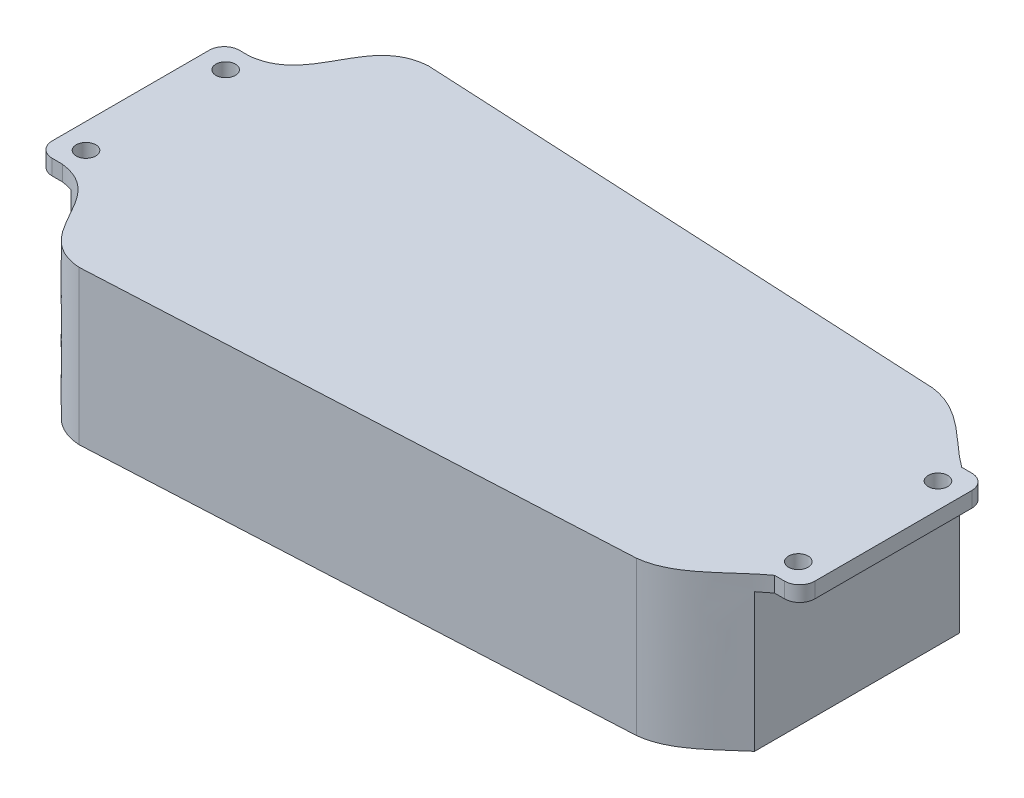
ISO-10303-21;
HEADER;
FILE_DESCRIPTION(('STEP AP214'),'2;1');
FILE_NAME('part.step','',(''),(''),'','','');
FILE_SCHEMA(('AUTOMOTIVE_DESIGN { 1 0 10303 214 1 1 1 1 }'));
ENDSEC;
DATA;
#1=APPLICATION_CONTEXT('core data for automotive mechanical design processes');
#2=APPLICATION_PROTOCOL_DEFINITION('international standard','automotive_design',2000,#1);
#3=PRODUCT_CONTEXT('',#1,'mechanical');
#4=PRODUCT('Part','Part','',(#3));
#5=PRODUCT_RELATED_PRODUCT_CATEGORY('part','',(#4));
#6=PRODUCT_DEFINITION_FORMATION('','',#4);
#7=PRODUCT_DEFINITION_CONTEXT('part definition',#1,'design');
#8=PRODUCT_DEFINITION('design','',#6,#7);
#9=PRODUCT_DEFINITION_SHAPE('','',#8);
#10=(LENGTH_UNIT() NAMED_UNIT(*) SI_UNIT(.MILLI.,.METRE.));
#11=(NAMED_UNIT(*) PLANE_ANGLE_UNIT() SI_UNIT($,.RADIAN.));
#12=(NAMED_UNIT(*) SI_UNIT($,.STERADIAN.) SOLID_ANGLE_UNIT());
#13=UNCERTAINTY_MEASURE_WITH_UNIT(LENGTH_MEASURE(1.E-05),#10,'distance_accuracy_value','');
#14=(GEOMETRIC_REPRESENTATION_CONTEXT(3) GLOBAL_UNCERTAINTY_ASSIGNED_CONTEXT((#13)) GLOBAL_UNIT_ASSIGNED_CONTEXT((#10,
#11,#12)) REPRESENTATION_CONTEXT('',''));
#15=CARTESIAN_POINT('',(0.,0.,0.));
#16=DIRECTION('',(0.,0.,1.));
#17=DIRECTION('',(1.,0.,0.));
#18=AXIS2_PLACEMENT_3D('',#15,#16,#17);
#19=CARTESIAN_POINT('',(-115.897393364929,-55.,32.5431279620853));
#20=DIRECTION('',(0.,-1.,0.));
#21=DIRECTION('',(0.,0.,-1.));
#22=AXIS2_PLACEMENT_3D('',#19,#20,#21);
#23=PLANE('',#22);
#24=CARTESIAN_POINT('',(142.702606635071,-55.,-29.0568720379147));
#25=CARTESIAN_POINT('',(133.287763268237,-55.,-35.7757587441816));
#26=CARTESIAN_POINT('',(125.082628435847,-55.,-47.1414686898549));
#27=CARTESIAN_POINT('',(112.637979465165,-55.,-48.4568720379147));
#28=B_SPLINE_CURVE_WITH_KNOTS('',3,(#24,#25,#26,#27),.UNSPECIFIED.,.F.,.F.,(4,4),(0.,1.),.UNSPECIFIED.);
#29=CARTESIAN_POINT('',(138.702606635071,-55.,-32.1976654202332));
#30=VERTEX_POINT('',#29);
#31=CARTESIAN_POINT('',(112.637979465165,-55.,-48.4568720379147));
#32=VERTEX_POINT('',#31);
#33=EDGE_CURVE('E536',#30,#32,#28,.T.);
#34=ORIENTED_EDGE('',*,*,#33,.F.);
#35=DIRECTION('',(0.,0.,1.));
#36=VECTOR('',#35,1.);
#37=CARTESIAN_POINT('',(138.702606635071,-55.,32.5431279620853));
#38=LINE('',#37,#36);
#39=CARTESIAN_POINT('',(138.702606635071,-55.,41.0839213444004));
#40=VERTEX_POINT('',#39);
#41=EDGE_CURVE('E273',#30,#40,#38,.T.);
#42=ORIENTED_EDGE('',*,*,#41,.T.);
#43=CARTESIAN_POINT('',(112.637979465165,-55.,57.3431279620853));
#44=CARTESIAN_POINT('',(125.082628435847,-55.,56.0277246140255));
#45=CARTESIAN_POINT('',(133.287763268237,-55.,44.6620146683521));
#46=CARTESIAN_POINT('',(142.702606635071,-55.,37.9431279620853));
#47=B_SPLINE_CURVE_WITH_KNOTS('',3,(#43,#44,#45,#46),.UNSPECIFIED.,.F.,.F.,(4,4),(0.,1.),.UNSPECIFIED.);
#48=CARTESIAN_POINT('',(112.637979465165,-55.,57.3431279620853));
#49=VERTEX_POINT('',#48);
#50=EDGE_CURVE('E542',#49,#40,#47,.T.);
#51=ORIENTED_EDGE('',*,*,#50,.F.);
#52=DIRECTION('',(0.998725119042121,0.,-0.0504790708541747));
#53=VECTOR('',#52,1.);
#54=CARTESIAN_POINT('',(-77.2973933649289,-55.,66.9431279620853));
#55=LINE('',#54,#53);
#56=CARTESIAN_POINT('',(-77.2973933649289,-55.,66.9431279620853));
#57=VERTEX_POINT('',#56);
#58=EDGE_CURVE('E349',#57,#49,#55,.T.);
#59=ORIENTED_EDGE('',*,*,#58,.F.);
#60=CARTESIAN_POINT('',(-112.297393364929,-55.,37.9431279620853));
#61=CARTESIAN_POINT('',(-92.6699085338427,-55.,40.1856361833209));
#62=CARTESIAN_POINT('',(-97.4782956804953,-55.,65.4447991108473));
#63=CARTESIAN_POINT('',(-77.2973933649289,-55.,66.9431279620853));
#64=B_SPLINE_CURVE_WITH_KNOTS('',3,(#60,#61,#62,#63),.UNSPECIFIED.,.F.,.F.,(4,4),(0.,1.),.UNSPECIFIED.);
#65=CARTESIAN_POINT('',(-108.297393364929,-55.,38.8081296548846));
#66=VERTEX_POINT('',#65);
#67=EDGE_CURVE('E343',#66,#57,#64,.T.);
#68=ORIENTED_EDGE('',*,*,#67,.F.);
#69=DIRECTION('',(0.,0.,-1.));
#70=VECTOR('',#69,1.);
#71=CARTESIAN_POINT('',(-108.297393364929,-55.,32.5431279620853));
#72=LINE('',#71,#70);
#73=CARTESIAN_POINT('',(-108.297393359178,-55.,-29.921873730714));
#74=VERTEX_POINT('',#73);
#75=EDGE_CURVE('E48',#66,#74,#72,.T.);
#76=ORIENTED_EDGE('',*,*,#75,.T.);
#77=CARTESIAN_POINT('',(-77.2973933649289,-55.,-58.0568720379147));
#78=CARTESIAN_POINT('',(-97.4782956804952,-55.,-56.5585431866767));
#79=CARTESIAN_POINT('',(-92.6699085338428,-55.,-31.2993802591503));
#80=CARTESIAN_POINT('',(-112.297393364929,-55.,-29.0568720379147));
#81=B_SPLINE_CURVE_WITH_KNOTS('',3,(#77,#78,#79,#80),.UNSPECIFIED.,.F.,.F.,(4,4),(0.,1.),.UNSPECIFIED.);
#82=CARTESIAN_POINT('',(-77.2973933649289,-55.,-58.0568720379147));
#83=VERTEX_POINT('',#82);
#84=EDGE_CURVE('E232',#83,#74,#81,.T.);
#85=ORIENTED_EDGE('',*,*,#84,.F.);
#86=DIRECTION('',(-0.998725119042121,0.,-0.0504790708541746));
#87=VECTOR('',#86,1.);
#88=CARTESIAN_POINT('',(-77.2973933649289,-55.,-58.0568720379147));
#89=LINE('',#88,#87);
#90=EDGE_CURVE('E410',#32,#83,#89,.T.);
#91=ORIENTED_EDGE('',*,*,#90,.F.);
#92=EDGE_LOOP('',(#34,#42,#51,#59,#68,#76,#85,#91));
#93=FACE_BOUND('',#92,.T.);
#94=ADVANCED_FACE('F39',(#93),#23,.T.);
#95=CARTESIAN_POINT('',(-115.897393364929,-55.,32.5431279620853));
#96=DIRECTION('',(0.,1.,0.));
#97=DIRECTION('',(0.,0.,1.));
#98=AXIS2_PLACEMENT_3D('',#95,#96,#97);
#99=CYLINDRICAL_SURFACE('',#98,5.4);
#100=CARTESIAN_POINT('',(-115.897393364929,-5.5,32.5431279620853));
#101=DIRECTION('',(0.,1.,0.));
#102=DIRECTION('',(0.,0.,1.));
#103=AXIS2_PLACEMENT_3D('',#100,#101,#102);
#104=CIRCLE('',#103,5.4);
#105=CARTESIAN_POINT('',(-115.897393364929,-5.5,37.9431279620853));
#106=VERTEX_POINT('',#105);
#107=CARTESIAN_POINT('',(-121.297393364929,-5.5,32.5431279620853));
#108=VERTEX_POINT('',#107);
#109=EDGE_CURVE('E300',#106,#108,#104,.F.);
#110=ORIENTED_EDGE('',*,*,#109,.F.);
#111=DIRECTION('',(0.,1.,0.));
#112=VECTOR('',#111,1.);
#113=CARTESIAN_POINT('',(-115.897393364929,-55.,37.9431279620853));
#114=LINE('',#113,#112);
#115=CARTESIAN_POINT('',(-115.897393364929,0.,37.9431279620853));
#116=VERTEX_POINT('',#115);
#117=EDGE_CURVE('E229',#106,#116,#114,.T.);
#118=ORIENTED_EDGE('',*,*,#117,.T.);
#119=CARTESIAN_POINT('',(-115.897393364929,0.,32.5431279620853));
#120=DIRECTION('',(0.,1.,0.));
#121=DIRECTION('',(0.,0.,-1.));
#122=AXIS2_PLACEMENT_3D('',#119,#120,#121);
#123=CIRCLE('',#122,5.4);
#124=CARTESIAN_POINT('',(-121.297393364929,0.,32.5431279620853));
#125=VERTEX_POINT('',#124);
#126=EDGE_CURVE('E342',#125,#116,#123,.T.);
#127=ORIENTED_EDGE('',*,*,#126,.F.);
#128=DIRECTION('',(0.,1.,0.));
#129=VECTOR('',#128,1.);
#130=CARTESIAN_POINT('',(-121.297393364929,-55.,32.5431279620853));
#131=LINE('',#130,#129);
#132=EDGE_CURVE('E240',#108,#125,#131,.T.);
#133=ORIENTED_EDGE('',*,*,#132,.F.);
#134=EDGE_LOOP('',(#110,#118,#127,#133));
#135=FACE_BOUND('',#134,.T.);
#136=ADVANCED_FACE('F41',(#135),#99,.T.);
#137=CARTESIAN_POINT('',(-121.297393364929,-55.,-23.6568720379147));
#138=DIRECTION('',(-1.,0.,0.));
#139=DIRECTION('',(0.,0.,1.));
#140=AXIS2_PLACEMENT_3D('',#137,#138,#139);
#141=PLANE('',#140);
#142=DIRECTION('',(0.,0.,-1.));
#143=VECTOR('',#142,1.);
#144=CARTESIAN_POINT('',(-121.297393364929,-5.5,-30.1667131943031));
#145=LINE('',#144,#143);
#146=CARTESIAN_POINT('',(-121.297393364929,-5.5,-23.6568720379147));
#147=VERTEX_POINT('',#146);
#148=EDGE_CURVE('E284',#108,#147,#145,.T.);
#149=ORIENTED_EDGE('',*,*,#148,.F.);
#150=ORIENTED_EDGE('',*,*,#132,.T.);
#151=DIRECTION('',(0.,0.,1.));
#152=VECTOR('',#151,1.);
#153=CARTESIAN_POINT('',(-121.297393364929,0.,-23.6568720379147));
#154=LINE('',#153,#152);
#155=CARTESIAN_POINT('',(-121.297393364929,0.,-23.6568720379147));
#156=VERTEX_POINT('',#155);
#157=EDGE_CURVE('E350',#156,#125,#154,.T.);
#158=ORIENTED_EDGE('',*,*,#157,.F.);
#159=DIRECTION('',(0.,1.,0.));
#160=VECTOR('',#159,1.);
#161=CARTESIAN_POINT('',(-121.297393364929,-55.,-23.6568720379147));
#162=LINE('',#161,#160);
#163=EDGE_CURVE('E496',#147,#156,#162,.T.);
#164=ORIENTED_EDGE('',*,*,#163,.F.);
#165=EDGE_LOOP('',(#149,#150,#158,#164));
#166=FACE_BOUND('',#165,.T.);
#167=ADVANCED_FACE('F379',(#166),#141,.T.);
#168=CARTESIAN_POINT('',(-115.897393364929,-55.,-23.6568720379147));
#169=DIRECTION('',(0.,1.,0.));
#170=DIRECTION('',(0.,0.,1.));
#171=AXIS2_PLACEMENT_3D('',#168,#169,#170);
#172=CYLINDRICAL_SURFACE('',#171,5.4);
#173=CARTESIAN_POINT('',(-115.897393364929,-5.5,-23.6568720379147));
#174=DIRECTION('',(0.,1.,0.));
#175=DIRECTION('',(0.,0.,1.));
#176=AXIS2_PLACEMENT_3D('',#173,#174,#175);
#177=CIRCLE('',#176,5.4);
#178=CARTESIAN_POINT('',(-115.897393364929,-5.5,-29.0568720379147));
#179=VERTEX_POINT('',#178);
#180=EDGE_CURVE('E317',#147,#179,#177,.F.);
#181=ORIENTED_EDGE('',*,*,#180,.F.);
#182=ORIENTED_EDGE('',*,*,#163,.T.);
#183=CARTESIAN_POINT('',(-115.897393364929,0.,-23.6568720379147));
#184=DIRECTION('',(0.,1.,0.));
#185=DIRECTION('',(0.,0.,1.));
#186=AXIS2_PLACEMENT_3D('',#183,#184,#185);
#187=CIRCLE('',#186,5.4);
#188=CARTESIAN_POINT('',(-115.897393364929,0.,-29.0568720379147));
#189=VERTEX_POINT('',#188);
#190=EDGE_CURVE('E487',#189,#156,#187,.T.);
#191=ORIENTED_EDGE('',*,*,#190,.F.);
#192=DIRECTION('',(0.,1.,0.));
#193=VECTOR('',#192,1.);
#194=CARTESIAN_POINT('',(-115.897393364929,-55.,-29.0568720379147));
#195=LINE('',#194,#193);
#196=EDGE_CURVE('E499',#179,#189,#195,.T.);
#197=ORIENTED_EDGE('',*,*,#196,.F.);
#198=EDGE_LOOP('',(#181,#182,#191,#197));
#199=FACE_BOUND('',#198,.T.);
#200=ADVANCED_FACE('F387',(#199),#172,.T.);
#201=CARTESIAN_POINT('',(-115.797393364929,-55.,-29.0568720379147));
#202=DIRECTION('',(0.,0.,-1.));
#203=DIRECTION('',(-1.,0.,0.));
#204=AXIS2_PLACEMENT_3D('',#201,#202,#203);
#205=PLANE('',#204);
#206=DIRECTION('',(1.,0.,0.));
#207=VECTOR('',#206,1.);
#208=CARTESIAN_POINT('',(-115.797393364929,-5.5,-29.0568720379147));
#209=LINE('',#208,#207);
#210=CARTESIAN_POINT('',(-112.297393364929,-5.5,-29.0568720379147));
#211=VERTEX_POINT('',#210);
#212=EDGE_CURVE('E311',#179,#211,#209,.T.);
#213=ORIENTED_EDGE('',*,*,#212,.F.);
#214=ORIENTED_EDGE('',*,*,#196,.T.);
#215=DIRECTION('',(-1.,0.,0.));
#216=VECTOR('',#215,1.);
#217=CARTESIAN_POINT('',(-115.797393364929,0.,-29.0568720379147));
#218=LINE('',#217,#216);
#219=CARTESIAN_POINT('',(-112.297393364929,0.,-29.0568720379147));
#220=VERTEX_POINT('',#219);
#221=EDGE_CURVE('E480',#220,#189,#218,.T.);
#222=ORIENTED_EDGE('',*,*,#221,.F.);
#223=DIRECTION('',(0.,1.,0.));
#224=VECTOR('',#223,1.);
#225=CARTESIAN_POINT('',(-112.297393364929,-55.,-29.0568720379147));
#226=LINE('',#225,#224);
#227=EDGE_CURVE('E502',#211,#220,#226,.T.);
#228=ORIENTED_EDGE('',*,*,#227,.F.);
#229=EDGE_LOOP('',(#213,#214,#222,#228));
#230=FACE_BOUND('',#229,.T.);
#231=ADVANCED_FACE('F391',(#230),#205,.T.);
#232=DIRECTION('',(0.,1.,0.));
#233=VECTOR('',#232,1.);
#234=SURFACE_OF_LINEAR_EXTRUSION('',#81,#233);
#235=CARTESIAN_POINT('',(-77.2973933649289,-5.5,-58.0568720379147));
#236=CARTESIAN_POINT('',(-97.4782956804952,-5.5,-56.5585431866767));
#237=CARTESIAN_POINT('',(-92.6699085338428,-5.5,-31.2993802591503));
#238=CARTESIAN_POINT('',(-112.297393364929,-5.5,-29.0568720379147));
#239=B_SPLINE_CURVE_WITH_KNOTS('',3,(#235,#236,#237,#238),.UNSPECIFIED.,.F.,.F.,(4,4),(0.,1.),.UNSPECIFIED.);
#240=CARTESIAN_POINT('',(-108.297393364929,-5.5,-29.9218737288001));
#241=VERTEX_POINT('',#240);
#242=EDGE_CURVE('E306',#211,#241,#239,.F.);
#243=ORIENTED_EDGE('',*,*,#242,.F.);
#244=ORIENTED_EDGE('',*,*,#227,.T.);
#245=CARTESIAN_POINT('',(-77.2973933649289,0.,-58.0568720379147));
#246=CARTESIAN_POINT('',(-97.4782956804952,0.,-56.5585431866767));
#247=CARTESIAN_POINT('',(-92.6699085338428,0.,-31.2993802591503));
#248=CARTESIAN_POINT('',(-112.297393364929,0.,-29.0568720379147));
#249=B_SPLINE_CURVE_WITH_KNOTS('',3,(#245,#246,#247,#248),.UNSPECIFIED.,.F.,.F.,(4,4),(0.,1.),.UNSPECIFIED.);
#250=CARTESIAN_POINT('',(-77.2973933649289,0.,-58.0568720379147));
#251=VERTEX_POINT('',#250);
#252=EDGE_CURVE('E474',#251,#220,#249,.T.);
#253=ORIENTED_EDGE('',*,*,#252,.F.);
#254=DIRECTION('',(0.,1.,0.));
#255=VECTOR('',#254,1.);
#256=CARTESIAN_POINT('',(-77.2973933649289,-55.,-58.0568720379147));
#257=LINE('',#256,#255);
#258=EDGE_CURVE('E505',#83,#251,#257,.T.);
#259=ORIENTED_EDGE('',*,*,#258,.F.);
#260=ORIENTED_EDGE('',*,*,#84,.T.);
#261=DIRECTION('',(0.,1.,0.));
#262=VECTOR('',#261,1.);
#263=CARTESIAN_POINT('',(-108.297393364929,-55.,-29.9218737288001));
#264=LINE('',#263,#262);
#265=EDGE_CURVE('E63',#74,#241,#264,.T.);
#266=ORIENTED_EDGE('',*,*,#265,.T.);
#267=EDGE_LOOP('',(#243,#244,#253,#259,#260,#266));
#268=FACE_BOUND('',#267,.T.);
#269=ADVANCED_FACE('F395',(#268),#234,.T.);
#270=CARTESIAN_POINT('',(-77.2973933649289,-55.,-58.0568720379147));
#271=DIRECTION('',(0.0504790708541746,0.,-0.998725119042121));
#272=DIRECTION('',(-0.998725119042121,0.,-0.0504790708541746));
#273=AXIS2_PLACEMENT_3D('',#270,#271,#272);
#274=PLANE('',#273);
#275=DIRECTION('',(-0.998725119042121,0.,-0.0504790708541746));
#276=VECTOR('',#275,1.);
#277=CARTESIAN_POINT('',(-77.2973933649289,0.,-58.0568720379147));
#278=LINE('',#277,#276);
#279=CARTESIAN_POINT('',(112.637979465165,0.,-48.4568720379147));
#280=VERTEX_POINT('',#279);
#281=EDGE_CURVE('E467',#280,#251,#278,.T.);
#282=ORIENTED_EDGE('',*,*,#281,.F.);
#283=DIRECTION('',(0.,1.,0.));
#284=VECTOR('',#283,1.);
#285=CARTESIAN_POINT('',(112.637979465165,-55.,-48.4568720379147));
#286=LINE('',#285,#284);
#287=EDGE_CURVE('E508',#32,#280,#286,.T.);
#288=ORIENTED_EDGE('',*,*,#287,.F.);
#289=ORIENTED_EDGE('',*,*,#90,.T.);
#290=ORIENTED_EDGE('',*,*,#258,.T.);
#291=EDGE_LOOP('',(#282,#288,#289,#290));
#292=FACE_BOUND('',#291,.T.);
#293=ADVANCED_FACE('F400',(#292),#274,.T.);
#294=DIRECTION('',(0.,1.,0.));
#295=VECTOR('',#294,1.);
#296=SURFACE_OF_LINEAR_EXTRUSION('',#28,#295);
#297=CARTESIAN_POINT('',(142.702606635071,-5.5,-29.0568720379147));
#298=CARTESIAN_POINT('',(133.287763268237,-5.5,-35.7757587441816));
#299=CARTESIAN_POINT('',(125.082628435847,-5.5,-47.1414686898549));
#300=CARTESIAN_POINT('',(112.637979465165,-5.5,-48.4568720379147));
#301=B_SPLINE_CURVE_WITH_KNOTS('',3,(#297,#298,#299,#300),.UNSPECIFIED.,.F.,.F.,(4,4),(0.,1.),.UNSPECIFIED.);
#302=CARTESIAN_POINT('',(138.702606635071,-5.5,-32.1976654202298));
#303=VERTEX_POINT('',#302);
#304=CARTESIAN_POINT('',(142.702606635071,-5.5,-29.0568720379147));
#305=VERTEX_POINT('',#304);
#306=EDGE_CURVE('E268',#303,#305,#301,.F.);
#307=ORIENTED_EDGE('',*,*,#306,.F.);
#308=DIRECTION('',(0.,1.,0.));
#309=VECTOR('',#308,1.);
#310=CARTESIAN_POINT('',(138.702606635071,-55.,-32.1976654202298));
#311=LINE('',#310,#309);
#312=EDGE_CURVE('E280',#303,#30,#311,.F.);
#313=ORIENTED_EDGE('',*,*,#312,.T.);
#314=ORIENTED_EDGE('',*,*,#33,.T.);
#315=ORIENTED_EDGE('',*,*,#287,.T.);
#316=CARTESIAN_POINT('',(142.702606635071,0.,-29.0568720379147));
#317=CARTESIAN_POINT('',(133.287763268237,0.,-35.7757587441816));
#318=CARTESIAN_POINT('',(125.082628435847,0.,-47.1414686898549));
#319=CARTESIAN_POINT('',(112.637979465165,0.,-48.4568720379147));
#320=B_SPLINE_CURVE_WITH_KNOTS('',3,(#316,#317,#318,#319),.UNSPECIFIED.,.F.,.F.,(4,4),(0.,1.),.UNSPECIFIED.);
#321=CARTESIAN_POINT('',(142.702606635071,0.,-29.0568720379147));
#322=VERTEX_POINT('',#321);
#323=EDGE_CURVE('E461',#322,#280,#320,.T.);
#324=ORIENTED_EDGE('',*,*,#323,.F.);
#325=DIRECTION('',(0.,1.,0.));
#326=VECTOR('',#325,1.);
#327=CARTESIAN_POINT('',(142.702606635071,-55.,-29.0568720379147));
#328=LINE('',#327,#326);
#329=EDGE_CURVE('E209',#305,#322,#328,.T.);
#330=ORIENTED_EDGE('',*,*,#329,.F.);
#331=EDGE_LOOP('',(#307,#313,#314,#315,#324,#330));
#332=FACE_BOUND('',#331,.T.);
#333=ADVANCED_FACE('F518',(#332),#296,.T.);
#334=CARTESIAN_POINT('',(146.202606635071,-55.,-29.0568720379147));
#335=DIRECTION('',(0.,0.,-1.));
#336=DIRECTION('',(-1.,0.,0.));
#337=AXIS2_PLACEMENT_3D('',#334,#335,#336);
#338=PLANE('',#337);
#339=DIRECTION('',(1.,0.,0.));
#340=VECTOR('',#339,1.);
#341=CARTESIAN_POINT('',(146.202606635071,-5.5,-29.0568720379147));
#342=LINE('',#341,#340);
#343=CARTESIAN_POINT('',(146.302606635071,-5.5,-29.0568720379147));
#344=VERTEX_POINT('',#343);
#345=EDGE_CURVE('E184',#305,#344,#342,.T.);
#346=ORIENTED_EDGE('',*,*,#345,.F.);
#347=ORIENTED_EDGE('',*,*,#329,.T.);
#348=DIRECTION('',(-1.,0.,0.));
#349=VECTOR('',#348,1.);
#350=CARTESIAN_POINT('',(146.202606635071,0.,-29.0568720379147));
#351=LINE('',#350,#349);
#352=CARTESIAN_POINT('',(146.302606635071,0.,-29.0568720379147));
#353=VERTEX_POINT('',#352);
#354=EDGE_CURVE('E457',#353,#322,#351,.T.);
#355=ORIENTED_EDGE('',*,*,#354,.F.);
#356=DIRECTION('',(0.,1.,0.));
#357=VECTOR('',#356,1.);
#358=CARTESIAN_POINT('',(146.302606635071,-55.,-29.0568720379147));
#359=LINE('',#358,#357);
#360=EDGE_CURVE('E205',#344,#353,#359,.T.);
#361=ORIENTED_EDGE('',*,*,#360,.F.);
#362=EDGE_LOOP('',(#346,#347,#355,#361));
#363=FACE_BOUND('',#362,.T.);
#364=ADVANCED_FACE('F515',(#363),#338,.T.);
#365=CARTESIAN_POINT('',(146.302606635071,-55.,-23.6568720379147));
#366=DIRECTION('',(0.,1.,0.));
#367=DIRECTION('',(0.,0.,1.));
#368=AXIS2_PLACEMENT_3D('',#365,#366,#367);
#369=CYLINDRICAL_SURFACE('',#368,5.40000000000002);
#370=CARTESIAN_POINT('',(146.302606635071,-5.5,-23.6568720379147));
#371=DIRECTION('',(0.,1.,0.));
#372=DIRECTION('',(0.,0.,1.));
#373=AXIS2_PLACEMENT_3D('',#370,#371,#372);
#374=CIRCLE('',#373,5.40000000000002);
#375=CARTESIAN_POINT('',(151.702606635071,-5.5,-23.6568720379147));
#376=VERTEX_POINT('',#375);
#377=EDGE_CURVE('E177',#344,#376,#374,.F.);
#378=ORIENTED_EDGE('',*,*,#377,.F.);
#379=ORIENTED_EDGE('',*,*,#360,.T.);
#380=CARTESIAN_POINT('',(146.302606635071,0.,-23.6568720379147));
#381=DIRECTION('',(0.,1.,0.));
#382=DIRECTION('',(0.,0.,-1.));
#383=AXIS2_PLACEMENT_3D('',#380,#381,#382);
#384=CIRCLE('',#383,5.40000000000002);
#385=CARTESIAN_POINT('',(151.702606635071,0.,-23.6568720379147));
#386=VERTEX_POINT('',#385);
#387=EDGE_CURVE('E202',#386,#353,#384,.T.);
#388=ORIENTED_EDGE('',*,*,#387,.F.);
#389=DIRECTION('',(0.,1.,0.));
#390=VECTOR('',#389,1.);
#391=CARTESIAN_POINT('',(151.702606635071,-55.,-23.6568720379147));
#392=LINE('',#391,#390);
#393=EDGE_CURVE('E195',#376,#386,#392,.T.);
#394=ORIENTED_EDGE('',*,*,#393,.F.);
#395=EDGE_LOOP('',(#378,#379,#388,#394));
#396=FACE_BOUND('',#395,.T.);
#397=ADVANCED_FACE('F200',(#396),#369,.T.);
#398=CARTESIAN_POINT('',(151.702606635071,-55.,-23.6568720379147));
#399=DIRECTION('',(1.,0.,0.));
#400=DIRECTION('',(0.,0.,-1.));
#401=AXIS2_PLACEMENT_3D('',#398,#399,#400);
#402=PLANE('',#401);
#403=DIRECTION('',(0.,0.,1.));
#404=VECTOR('',#403,1.);
#405=CARTESIAN_POINT('',(151.702606635071,-5.5,42.5271998288506));
#406=LINE('',#405,#404);
#407=CARTESIAN_POINT('',(151.702606635071,-5.5,32.5431279620853));
#408=VERTEX_POINT('',#407);
#409=EDGE_CURVE('E181',#376,#408,#406,.T.);
#410=ORIENTED_EDGE('',*,*,#409,.F.);
#411=ORIENTED_EDGE('',*,*,#393,.T.);
#412=DIRECTION('',(0.,0.,-1.));
#413=VECTOR('',#412,1.);
#414=CARTESIAN_POINT('',(151.702606635071,0.,-23.6568720379147));
#415=LINE('',#414,#413);
#416=CARTESIAN_POINT('',(151.702606635071,0.,32.5431279620853));
#417=VERTEX_POINT('',#416);
#418=EDGE_CURVE('E452',#417,#386,#415,.T.);
#419=ORIENTED_EDGE('',*,*,#418,.F.);
#420=DIRECTION('',(0.,1.,0.));
#421=VECTOR('',#420,1.);
#422=CARTESIAN_POINT('',(151.702606635071,-55.,32.5431279620853));
#423=LINE('',#422,#421);
#424=EDGE_CURVE('E197',#408,#417,#423,.T.);
#425=ORIENTED_EDGE('',*,*,#424,.F.);
#426=EDGE_LOOP('',(#410,#411,#419,#425));
#427=FACE_BOUND('',#426,.T.);
#428=ADVANCED_FACE('F193',(#427),#402,.T.);
#429=CARTESIAN_POINT('',(146.302606635071,-55.,32.5431279620853));
#430=DIRECTION('',(0.,1.,0.));
#431=DIRECTION('',(0.,0.,1.));
#432=AXIS2_PLACEMENT_3D('',#429,#430,#431);
#433=CYLINDRICAL_SURFACE('',#432,5.40000000000002);
#434=CARTESIAN_POINT('',(146.302606635071,-5.5,32.5431279620853));
#435=DIRECTION('',(0.,1.,0.));
#436=DIRECTION('',(0.,0.,1.));
#437=AXIS2_PLACEMENT_3D('',#434,#435,#436);
#438=CIRCLE('',#437,5.40000000000002);
#439=CARTESIAN_POINT('',(146.302606635071,-5.5,37.9431279620853));
#440=VERTEX_POINT('',#439);
#441=EDGE_CURVE('E189',#408,#440,#438,.F.);
#442=ORIENTED_EDGE('',*,*,#441,.F.);
#443=ORIENTED_EDGE('',*,*,#424,.T.);
#444=CARTESIAN_POINT('',(146.302606635071,0.,32.5431279620853));
#445=DIRECTION('',(0.,1.,0.));
#446=DIRECTION('',(0.,0.,1.));
#447=AXIS2_PLACEMENT_3D('',#444,#445,#446);
#448=CIRCLE('',#447,5.40000000000002);
#449=CARTESIAN_POINT('',(146.302606635071,0.,37.9431279620853));
#450=VERTEX_POINT('',#449);
#451=EDGE_CURVE('E448',#450,#417,#448,.T.);
#452=ORIENTED_EDGE('',*,*,#451,.F.);
#453=DIRECTION('',(0.,1.,0.));
#454=VECTOR('',#453,1.);
#455=CARTESIAN_POINT('',(146.302606635071,-55.,37.9431279620853));
#456=LINE('',#455,#454);
#457=EDGE_CURVE('E211',#440,#450,#456,.T.);
#458=ORIENTED_EDGE('',*,*,#457,.F.);
#459=EDGE_LOOP('',(#442,#443,#452,#458));
#460=FACE_BOUND('',#459,.T.);
#461=ADVANCED_FACE('F526',(#460),#433,.T.);
#462=CARTESIAN_POINT('',(146.202606635071,-55.,37.9431279620853));
#463=DIRECTION('',(0.,0.,1.));
#464=DIRECTION('',(1.,0.,0.));
#465=AXIS2_PLACEMENT_3D('',#462,#463,#464);
#466=PLANE('',#465);
#467=DIRECTION('',(-1.,0.,0.));
#468=VECTOR('',#467,1.);
#469=CARTESIAN_POINT('',(146.202606635071,-5.5,37.9431279620853));
#470=LINE('',#469,#468);
#471=CARTESIAN_POINT('',(142.702606635071,-5.5,37.9431279620853));
#472=VERTEX_POINT('',#471);
#473=EDGE_CURVE('E258',#440,#472,#470,.T.);
#474=ORIENTED_EDGE('',*,*,#473,.F.);
#475=ORIENTED_EDGE('',*,*,#457,.T.);
#476=DIRECTION('',(1.,0.,0.));
#477=VECTOR('',#476,1.);
#478=CARTESIAN_POINT('',(146.202606635071,0.,37.9431279620853));
#479=LINE('',#478,#477);
#480=CARTESIAN_POINT('',(142.702606635071,0.,37.9431279620853));
#481=VERTEX_POINT('',#480);
#482=EDGE_CURVE('E441',#481,#450,#479,.T.);
#483=ORIENTED_EDGE('',*,*,#482,.F.);
#484=DIRECTION('',(0.,1.,0.));
#485=VECTOR('',#484,1.);
#486=CARTESIAN_POINT('',(142.702606635071,-55.,37.9431279620853));
#487=LINE('',#486,#485);
#488=EDGE_CURVE('E217',#472,#481,#487,.T.);
#489=ORIENTED_EDGE('',*,*,#488,.F.);
#490=EDGE_LOOP('',(#474,#475,#483,#489));
#491=FACE_BOUND('',#490,.T.);
#492=ADVANCED_FACE('F531',(#491),#466,.T.);
#493=DIRECTION('',(0.,1.,0.));
#494=VECTOR('',#493,1.);
#495=SURFACE_OF_LINEAR_EXTRUSION('',#47,#494);
#496=CARTESIAN_POINT('',(112.637979465165,-5.5,57.3431279620853));
#497=CARTESIAN_POINT('',(125.082628435847,-5.5,56.0277246140255));
#498=CARTESIAN_POINT('',(133.287763268237,-5.5,44.6620146683521));
#499=CARTESIAN_POINT('',(142.702606635071,-5.5,37.9431279620853));
#500=B_SPLINE_CURVE_WITH_KNOTS('',3,(#496,#497,#498,#499),.UNSPECIFIED.,.F.,.F.,(4,4),(0.,1.),.UNSPECIFIED.);
#501=CARTESIAN_POINT('',(138.702606635071,-5.5,41.0839213444004));
#502=VERTEX_POINT('',#501);
#503=EDGE_CURVE('E250',#472,#502,#500,.F.);
#504=ORIENTED_EDGE('',*,*,#503,.F.);
#505=ORIENTED_EDGE('',*,*,#488,.T.);
#506=CARTESIAN_POINT('',(112.637979465165,0.,57.3431279620853));
#507=CARTESIAN_POINT('',(125.082628435847,0.,56.0277246140255));
#508=CARTESIAN_POINT('',(133.287763268237,0.,44.6620146683521));
#509=CARTESIAN_POINT('',(142.702606635071,0.,37.9431279620853));
#510=B_SPLINE_CURVE_WITH_KNOTS('',3,(#506,#507,#508,#509),.UNSPECIFIED.,.F.,.F.,(4,4),(0.,1.),.UNSPECIFIED.);
#511=CARTESIAN_POINT('',(112.637979465165,0.,57.3431279620853));
#512=VERTEX_POINT('',#511);
#513=EDGE_CURVE('E435',#512,#481,#510,.T.);
#514=ORIENTED_EDGE('',*,*,#513,.F.);
#515=DIRECTION('',(0.,1.,0.));
#516=VECTOR('',#515,1.);
#517=CARTESIAN_POINT('',(112.637979465165,-55.,57.3431279620853));
#518=LINE('',#517,#516);
#519=EDGE_CURVE('E220',#49,#512,#518,.T.);
#520=ORIENTED_EDGE('',*,*,#519,.F.);
#521=ORIENTED_EDGE('',*,*,#50,.T.);
#522=DIRECTION('',(0.,1.,0.));
#523=VECTOR('',#522,1.);
#524=CARTESIAN_POINT('',(138.702606635071,-55.,41.0839213444004));
#525=LINE('',#524,#523);
#526=EDGE_CURVE('E11',#40,#502,#525,.T.);
#527=ORIENTED_EDGE('',*,*,#526,.T.);
#528=EDGE_LOOP('',(#504,#505,#514,#520,#521,#527));
#529=FACE_BOUND('',#528,.T.);
#530=ADVANCED_FACE('F534',(#529),#495,.T.);
#531=CARTESIAN_POINT('',(-77.2973933649289,-55.,66.9431279620853));
#532=DIRECTION('',(0.0504790708541747,0.,0.998725119042121));
#533=DIRECTION('',(0.998725119042121,0.,-0.0504790708541747));
#534=AXIS2_PLACEMENT_3D('',#531,#532,#533);
#535=PLANE('',#534);
#536=DIRECTION('',(0.998725119042121,0.,-0.0504790708541747));
#537=VECTOR('',#536,1.);
#538=CARTESIAN_POINT('',(-77.2973933649289,0.,66.9431279620853));
#539=LINE('',#538,#537);
#540=CARTESIAN_POINT('',(-77.2973933649289,0.,66.9431279620853));
#541=VERTEX_POINT('',#540);
#542=EDGE_CURVE('E428',#541,#512,#539,.T.);
#543=ORIENTED_EDGE('',*,*,#542,.F.);
#544=DIRECTION('',(0.,1.,0.));
#545=VECTOR('',#544,1.);
#546=CARTESIAN_POINT('',(-77.2973933649289,-55.,66.9431279620853));
#547=LINE('',#546,#545);
#548=EDGE_CURVE('E223',#57,#541,#547,.T.);
#549=ORIENTED_EDGE('',*,*,#548,.F.);
#550=ORIENTED_EDGE('',*,*,#58,.T.);
#551=ORIENTED_EDGE('',*,*,#519,.T.);
#552=EDGE_LOOP('',(#543,#549,#550,#551));
#553=FACE_BOUND('',#552,.T.);
#554=ADVANCED_FACE('F360',(#553),#535,.T.);
#555=DIRECTION('',(0.,1.,0.));
#556=VECTOR('',#555,1.);
#557=SURFACE_OF_LINEAR_EXTRUSION('',#64,#556);
#558=CARTESIAN_POINT('',(-112.297393364929,-5.5,37.9431279620853));
#559=CARTESIAN_POINT('',(-92.6699085338427,-5.5,40.1856361833209));
#560=CARTESIAN_POINT('',(-97.4782956804953,-5.5,65.4447991108473));
#561=CARTESIAN_POINT('',(-77.2973933649289,-5.5,66.9431279620853));
#562=B_SPLINE_CURVE_WITH_KNOTS('',3,(#558,#559,#560,#561),.UNSPECIFIED.,.F.,.F.,(4,4),(0.,1.),.UNSPECIFIED.);
#563=CARTESIAN_POINT('',(-108.297393364929,-5.5,38.8081296529707));
#564=VERTEX_POINT('',#563);
#565=CARTESIAN_POINT('',(-112.297393364929,-5.5,37.9431279620853));
#566=VERTEX_POINT('',#565);
#567=EDGE_CURVE('E295',#564,#566,#562,.F.);
#568=ORIENTED_EDGE('',*,*,#567,.F.);
#569=DIRECTION('',(0.,1.,0.));
#570=VECTOR('',#569,1.);
#571=CARTESIAN_POINT('',(-108.297393364929,-55.,38.8081296529707));
#572=LINE('',#571,#570);
#573=EDGE_CURVE('E320',#564,#66,#572,.F.);
#574=ORIENTED_EDGE('',*,*,#573,.T.);
#575=ORIENTED_EDGE('',*,*,#67,.T.);
#576=ORIENTED_EDGE('',*,*,#548,.T.);
#577=CARTESIAN_POINT('',(-112.297393364929,0.,37.9431279620853));
#578=CARTESIAN_POINT('',(-92.6699085338427,0.,40.1856361833209));
#579=CARTESIAN_POINT('',(-97.4782956804953,0.,65.4447991108473));
#580=CARTESIAN_POINT('',(-77.2973933649289,0.,66.9431279620853));
#581=B_SPLINE_CURVE_WITH_KNOTS('',3,(#577,#578,#579,#580),.UNSPECIFIED.,.F.,.F.,(4,4),(0.,1.),.UNSPECIFIED.);
#582=CARTESIAN_POINT('',(-112.297393364929,0.,37.9431279620853));
#583=VERTEX_POINT('',#582);
#584=EDGE_CURVE('E422',#583,#541,#581,.T.);
#585=ORIENTED_EDGE('',*,*,#584,.F.);
#586=DIRECTION('',(0.,1.,0.));
#587=VECTOR('',#586,1.);
#588=CARTESIAN_POINT('',(-112.297393364929,-55.,37.9431279620853));
#589=LINE('',#588,#587);
#590=EDGE_CURVE('E226',#566,#583,#589,.T.);
#591=ORIENTED_EDGE('',*,*,#590,.F.);
#592=EDGE_LOOP('',(#568,#574,#575,#576,#585,#591));
#593=FACE_BOUND('',#592,.T.);
#594=ADVANCED_FACE('F356',(#593),#557,.T.);
#595=CARTESIAN_POINT('',(-115.797393364929,-55.,37.9431279620853));
#596=DIRECTION('',(0.,0.,1.));
#597=DIRECTION('',(1.,0.,0.));
#598=AXIS2_PLACEMENT_3D('',#595,#596,#597);
#599=PLANE('',#598);
#600=DIRECTION('',(-1.,0.,0.));
#601=VECTOR('',#600,1.);
#602=CARTESIAN_POINT('',(-115.797393364929,-5.5,37.9431279620853));
#603=LINE('',#602,#601);
#604=EDGE_CURVE('E292',#566,#106,#603,.T.);
#605=ORIENTED_EDGE('',*,*,#604,.F.);
#606=ORIENTED_EDGE('',*,*,#590,.T.);
#607=DIRECTION('',(1.,0.,0.));
#608=VECTOR('',#607,1.);
#609=CARTESIAN_POINT('',(-115.797393364929,0.,37.9431279620853));
#610=LINE('',#609,#608);
#611=EDGE_CURVE('E418',#116,#583,#610,.T.);
#612=ORIENTED_EDGE('',*,*,#611,.F.);
#613=ORIENTED_EDGE('',*,*,#117,.F.);
#614=EDGE_LOOP('',(#605,#606,#612,#613));
#615=FACE_BOUND('',#614,.T.);
#616=ADVANCED_FACE('F359',(#615),#599,.T.);
#617=CARTESIAN_POINT('',(-115.897393364929,0.,32.5431279620853));
#618=DIRECTION('',(0.,-1.,0.));
#619=DIRECTION('',(0.,0.,-1.));
#620=AXIS2_PLACEMENT_3D('',#617,#618,#619);
#621=PLANE('',#620);
#622=CARTESIAN_POINT('',(142.702606635071,0.,-20.5568720379147));
#623=DIRECTION('',(0.,1.,0.));
#624=DIRECTION('',(0.,0.,-1.));
#625=AXIS2_PLACEMENT_3D('',#622,#623,#624);
#626=CIRCLE('',#625,3.49999999999999);
#627=CARTESIAN_POINT('',(142.702606635071,0.,-24.0568720379147));
#628=VERTEX_POINT('',#627);
#629=EDGE_CURVE('E326',#628,#628,#626,.T.);
#630=ORIENTED_EDGE('',*,*,#629,.F.);
#631=EDGE_LOOP('',(#630));
#632=FACE_BOUND('',#631,.T.);
#633=CARTESIAN_POINT('',(142.702606635071,0.,29.4431279620853));
#634=DIRECTION('',(0.,1.,0.));
#635=DIRECTION('',(0.,0.,-1.));
#636=AXIS2_PLACEMENT_3D('',#633,#634,#635);
#637=CIRCLE('',#636,3.49999999999999);
#638=CARTESIAN_POINT('',(142.702606635071,0.,25.9431279620853));
#639=VERTEX_POINT('',#638);
#640=EDGE_CURVE('E330',#639,#639,#637,.T.);
#641=ORIENTED_EDGE('',*,*,#640,.F.);
#642=EDGE_LOOP('',(#641));
#643=FACE_BOUND('',#642,.T.);
#644=CARTESIAN_POINT('',(-112.297393364929,0.,29.4431279620853));
#645=DIRECTION('',(0.,1.,0.));
#646=DIRECTION('',(0.,0.,1.));
#647=AXIS2_PLACEMENT_3D('',#644,#645,#646);
#648=CIRCLE('',#647,3.50000000000001);
#649=CARTESIAN_POINT('',(-112.297393364929,0.,32.9431279620853));
#650=VERTEX_POINT('',#649);
#651=EDGE_CURVE('E334',#650,#650,#648,.T.);
#652=ORIENTED_EDGE('',*,*,#651,.F.);
#653=EDGE_LOOP('',(#652));
#654=FACE_BOUND('',#653,.T.);
#655=CARTESIAN_POINT('',(-112.297393364929,0.,-20.5568720379147));
#656=DIRECTION('',(0.,1.,0.));
#657=DIRECTION('',(0.,0.,1.));
#658=AXIS2_PLACEMENT_3D('',#655,#656,#657);
#659=CIRCLE('',#658,3.50000000000001);
#660=CARTESIAN_POINT('',(-112.297393364929,0.,-17.0568720379147));
#661=VERTEX_POINT('',#660);
#662=EDGE_CURVE('E338',#661,#661,#659,.T.);
#663=ORIENTED_EDGE('',*,*,#662,.F.);
#664=EDGE_LOOP('',(#663));
#665=FACE_BOUND('',#664,.T.);
#666=ORIENTED_EDGE('',*,*,#126,.T.);
#667=ORIENTED_EDGE('',*,*,#611,.T.);
#668=ORIENTED_EDGE('',*,*,#584,.T.);
#669=ORIENTED_EDGE('',*,*,#542,.T.);
#670=ORIENTED_EDGE('',*,*,#513,.T.);
#671=ORIENTED_EDGE('',*,*,#482,.T.);
#672=ORIENTED_EDGE('',*,*,#451,.T.);
#673=ORIENTED_EDGE('',*,*,#418,.T.);
#674=ORIENTED_EDGE('',*,*,#387,.T.);
#675=ORIENTED_EDGE('',*,*,#354,.T.);
#676=ORIENTED_EDGE('',*,*,#323,.T.);
#677=ORIENTED_EDGE('',*,*,#281,.T.);
#678=ORIENTED_EDGE('',*,*,#252,.T.);
#679=ORIENTED_EDGE('',*,*,#221,.T.);
#680=ORIENTED_EDGE('',*,*,#190,.T.);
#681=ORIENTED_EDGE('',*,*,#157,.T.);
#682=EDGE_LOOP('',(#666,#667,#668,#669,#670,#671,#672,#673,#674,#675,#676,#677,#678,#679,#680,#681));
#683=FACE_BOUND('',#682,.T.);
#684=ADVANCED_FACE('F364',(#632,#643,#654,#665,#683),#621,.F.);
#685=CARTESIAN_POINT('',(-112.297393364929,-55.,-20.5568720379147));
#686=DIRECTION('',(0.,1.,0.));
#687=DIRECTION('',(0.,0.,1.));
#688=AXIS2_PLACEMENT_3D('',#685,#686,#687);
#689=CYLINDRICAL_SURFACE('',#688,3.50000000000001);
#690=CARTESIAN_POINT('',(-112.297393364929,-5.5,-20.5568720379147));
#691=DIRECTION('',(0.,1.,0.));
#692=DIRECTION('',(0.,0.,1.));
#693=AXIS2_PLACEMENT_3D('',#690,#691,#692);
#694=CIRCLE('',#693,3.50000000000001);
#695=CARTESIAN_POINT('',(-112.297393364929,-5.5,-17.0568720379147));
#696=VERTEX_POINT('',#695);
#697=EDGE_CURVE('E237',#696,#696,#694,.F.);
#698=ORIENTED_EDGE('',*,*,#697,.T.);
#699=EDGE_LOOP('',(#698));
#700=FACE_BOUND('',#699,.T.);
#701=ORIENTED_EDGE('',*,*,#662,.T.);
#702=EDGE_LOOP('',(#701));
#703=FACE_BOUND('',#702,.T.);
#704=ADVANCED_FACE('F369',(#700,#703),#689,.F.);
#705=CARTESIAN_POINT('',(-112.297393364929,-55.,29.4431279620853));
#706=DIRECTION('',(0.,1.,0.));
#707=DIRECTION('',(0.,0.,1.));
#708=AXIS2_PLACEMENT_3D('',#705,#706,#707);
#709=CYLINDRICAL_SURFACE('',#708,3.50000000000001);
#710=CARTESIAN_POINT('',(-112.297393364929,-5.5,29.4431279620853));
#711=DIRECTION('',(0.,1.,0.));
#712=DIRECTION('',(0.,0.,1.));
#713=AXIS2_PLACEMENT_3D('',#710,#711,#712);
#714=CIRCLE('',#713,3.50000000000001);
#715=CARTESIAN_POINT('',(-112.297393364929,-5.5,32.9431279620853));
#716=VERTEX_POINT('',#715);
#717=EDGE_CURVE('E233',#716,#716,#714,.F.);
#718=ORIENTED_EDGE('',*,*,#717,.T.);
#719=EDGE_LOOP('',(#718));
#720=FACE_BOUND('',#719,.T.);
#721=ORIENTED_EDGE('',*,*,#651,.T.);
#722=EDGE_LOOP('',(#721));
#723=FACE_BOUND('',#722,.T.);
#724=ADVANCED_FACE('F619',(#720,#723),#709,.F.);
#725=CARTESIAN_POINT('',(142.702606635071,-55.,29.4431279620853));
#726=DIRECTION('',(0.,1.,0.));
#727=DIRECTION('',(0.,0.,1.));
#728=AXIS2_PLACEMENT_3D('',#725,#726,#727);
#729=CYLINDRICAL_SURFACE('',#728,3.49999999999999);
#730=CARTESIAN_POINT('',(142.702606635071,-5.5,29.4431279620853));
#731=DIRECTION('',(0.,1.,0.));
#732=DIRECTION('',(0.,0.,1.));
#733=AXIS2_PLACEMENT_3D('',#730,#731,#732);
#734=CIRCLE('',#733,3.49999999999999);
#735=CARTESIAN_POINT('',(142.702606635071,-5.5,32.9431279620853));
#736=VERTEX_POINT('',#735);
#737=EDGE_CURVE('E244',#736,#736,#734,.F.);
#738=ORIENTED_EDGE('',*,*,#737,.T.);
#739=EDGE_LOOP('',(#738));
#740=FACE_BOUND('',#739,.T.);
#741=ORIENTED_EDGE('',*,*,#640,.T.);
#742=EDGE_LOOP('',(#741));
#743=FACE_BOUND('',#742,.T.);
#744=ADVANCED_FACE('F617',(#740,#743),#729,.F.);
#745=CARTESIAN_POINT('',(142.702606635071,-55.,-20.5568720379147));
#746=DIRECTION('',(0.,1.,0.));
#747=DIRECTION('',(0.,0.,1.));
#748=AXIS2_PLACEMENT_3D('',#745,#746,#747);
#749=CYLINDRICAL_SURFACE('',#748,3.49999999999999);
#750=CARTESIAN_POINT('',(142.702606635071,-5.5,-20.5568720379147));
#751=DIRECTION('',(0.,1.,0.));
#752=DIRECTION('',(0.,0.,1.));
#753=AXIS2_PLACEMENT_3D('',#750,#751,#752);
#754=CIRCLE('',#753,3.49999999999999);
#755=CARTESIAN_POINT('',(142.702606635071,-5.5,-17.0568720379147));
#756=VERTEX_POINT('',#755);
#757=EDGE_CURVE('E241',#756,#756,#754,.F.);
#758=ORIENTED_EDGE('',*,*,#757,.T.);
#759=EDGE_LOOP('',(#758));
#760=FACE_BOUND('',#759,.T.);
#761=ORIENTED_EDGE('',*,*,#629,.T.);
#762=EDGE_LOOP('',(#761));
#763=FACE_BOUND('',#762,.T.);
#764=ADVANCED_FACE('F611',(#760,#763),#749,.F.);
#765=CARTESIAN_POINT('',(-108.297393364929,-5.5,-30.1667131943031));
#766=DIRECTION('',(0.,1.,0.));
#767=DIRECTION('',(0.,0.,1.));
#768=AXIS2_PLACEMENT_3D('',#765,#766,#767);
#769=PLANE('',#768);
#770=ORIENTED_EDGE('',*,*,#180,.T.);
#771=ORIENTED_EDGE('',*,*,#212,.T.);
#772=ORIENTED_EDGE('',*,*,#242,.T.);
#773=DIRECTION('',(0.,0.,-1.));
#774=VECTOR('',#773,1.);
#775=CARTESIAN_POINT('',(-108.297393364929,-5.5,-30.1667131943031));
#776=LINE('',#775,#774);
#777=EDGE_CURVE('E238',#564,#241,#776,.T.);
#778=ORIENTED_EDGE('',*,*,#777,.F.);
#779=ORIENTED_EDGE('',*,*,#567,.T.);
#780=ORIENTED_EDGE('',*,*,#604,.T.);
#781=ORIENTED_EDGE('',*,*,#109,.T.);
#782=ORIENTED_EDGE('',*,*,#148,.T.);
#783=EDGE_LOOP('',(#770,#771,#772,#778,#779,#780,#781,#782));
#784=FACE_BOUND('',#783,.T.);
#785=ORIENTED_EDGE('',*,*,#717,.F.);
#786=EDGE_LOOP('',(#785));
#787=FACE_BOUND('',#786,.T.);
#788=ORIENTED_EDGE('',*,*,#697,.F.);
#789=EDGE_LOOP('',(#788));
#790=FACE_BOUND('',#789,.T.);
#791=ADVANCED_FACE('F599',(#784,#787,#790),#769,.F.);
#792=CARTESIAN_POINT('',(-108.297393364929,0.,0.));
#793=DIRECTION('',(-1.,0.,0.));
#794=DIRECTION('',(0.,0.,1.));
#795=AXIS2_PLACEMENT_3D('',#792,#793,#794);
#796=PLANE('',#795);
#797=ORIENTED_EDGE('',*,*,#75,.F.);
#798=ORIENTED_EDGE('',*,*,#573,.F.);
#799=ORIENTED_EDGE('',*,*,#777,.T.);
#800=ORIENTED_EDGE('',*,*,#265,.F.);
#801=EDGE_LOOP('',(#797,#798,#799,#800));
#802=FACE_BOUND('',#801,.T.);
#803=ADVANCED_FACE('F602',(#802),#796,.T.);
#804=CARTESIAN_POINT('',(138.702606635071,-5.5,42.5271998288506));
#805=DIRECTION('',(0.,1.,0.));
#806=DIRECTION('',(0.,0.,1.));
#807=AXIS2_PLACEMENT_3D('',#804,#805,#806);
#808=PLANE('',#807);
#809=ORIENTED_EDGE('',*,*,#306,.T.);
#810=ORIENTED_EDGE('',*,*,#345,.T.);
#811=ORIENTED_EDGE('',*,*,#377,.T.);
#812=ORIENTED_EDGE('',*,*,#409,.T.);
#813=ORIENTED_EDGE('',*,*,#441,.T.);
#814=ORIENTED_EDGE('',*,*,#473,.T.);
#815=ORIENTED_EDGE('',*,*,#503,.T.);
#816=DIRECTION('',(0.,0.,1.));
#817=VECTOR('',#816,1.);
#818=CARTESIAN_POINT('',(138.702606635071,-5.5,42.5271998288506));
#819=LINE('',#818,#817);
#820=EDGE_CURVE('E55',#303,#502,#819,.T.);
#821=ORIENTED_EDGE('',*,*,#820,.F.);
#822=EDGE_LOOP('',(#809,#810,#811,#812,#813,#814,#815,#821));
#823=FACE_BOUND('',#822,.T.);
#824=ORIENTED_EDGE('',*,*,#757,.F.);
#825=EDGE_LOOP('',(#824));
#826=FACE_BOUND('',#825,.T.);
#827=ORIENTED_EDGE('',*,*,#737,.F.);
#828=EDGE_LOOP('',(#827));
#829=FACE_BOUND('',#828,.T.);
#830=ADVANCED_FACE('F179',(#823,#826,#829),#808,.F.);
#831=CARTESIAN_POINT('',(138.702606635071,0.,0.));
#832=DIRECTION('',(1.,0.,0.));
#833=DIRECTION('',(0.,0.,-1.));
#834=AXIS2_PLACEMENT_3D('',#831,#832,#833);
#835=PLANE('',#834);
#836=ORIENTED_EDGE('',*,*,#820,.T.);
#837=ORIENTED_EDGE('',*,*,#526,.F.);
#838=ORIENTED_EDGE('',*,*,#41,.F.);
#839=ORIENTED_EDGE('',*,*,#312,.F.);
#840=EDGE_LOOP('',(#836,#837,#838,#839));
#841=FACE_BOUND('',#840,.T.);
#842=ADVANCED_FACE('F609',(#841),#835,.T.);
#843=CLOSED_SHELL('',(#94,#136,#167,#200,#231,#269,#293,#333,#364,#397,#428,#461,#492,#530,#554,
#594,#616,#684,#704,#724,#744,#764,#791,#803,#830,#842));
#844=MANIFOLD_SOLID_BREP('B2',#843);
#845=ADVANCED_BREP_SHAPE_REPRESENTATION('',(#18,#844),#14);
#846=SHAPE_DEFINITION_REPRESENTATION(#9,#845);
ENDSEC;
END-ISO-10303-21;
